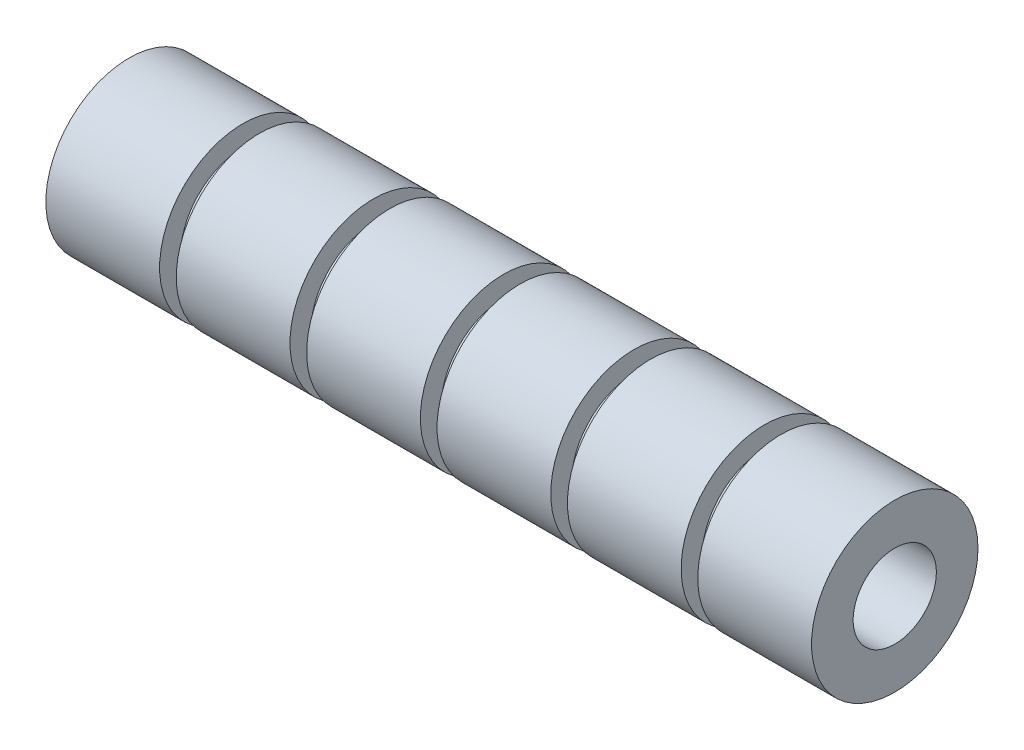
ISO-10303-21;
HEADER;
FILE_DESCRIPTION(('STEP AP214'),'2;1');
FILE_NAME('part.step','',(''),(''),'','','');
FILE_SCHEMA(('AUTOMOTIVE_DESIGN { 1 0 10303 214 1 1 1 1 }'));
ENDSEC;
DATA;
#1=APPLICATION_CONTEXT('core data for automotive mechanical design processes');
#2=APPLICATION_PROTOCOL_DEFINITION('international standard','automotive_design',2000,#1);
#3=PRODUCT_CONTEXT('',#1,'mechanical');
#4=PRODUCT('Part','Part','',(#3));
#5=PRODUCT_RELATED_PRODUCT_CATEGORY('part','',(#4));
#6=PRODUCT_DEFINITION_FORMATION('','',#4);
#7=PRODUCT_DEFINITION_CONTEXT('part definition',#1,'design');
#8=PRODUCT_DEFINITION('design','',#6,#7);
#9=PRODUCT_DEFINITION_SHAPE('','',#8);
#10=(LENGTH_UNIT() NAMED_UNIT(*) SI_UNIT(.MILLI.,.METRE.));
#11=(NAMED_UNIT(*) PLANE_ANGLE_UNIT() SI_UNIT($,.RADIAN.));
#12=(NAMED_UNIT(*) SI_UNIT($,.STERADIAN.) SOLID_ANGLE_UNIT());
#13=UNCERTAINTY_MEASURE_WITH_UNIT(LENGTH_MEASURE(1.E-05),#10,'distance_accuracy_value','');
#14=(GEOMETRIC_REPRESENTATION_CONTEXT(3) GLOBAL_UNCERTAINTY_ASSIGNED_CONTEXT((#13)) GLOBAL_UNIT_ASSIGNED_CONTEXT((#10,
#11,#12)) REPRESENTATION_CONTEXT('',''));
#15=CARTESIAN_POINT('',(0.,0.,0.));
#16=DIRECTION('',(0.,0.,1.));
#17=DIRECTION('',(1.,0.,0.));
#18=AXIS2_PLACEMENT_3D('',#15,#16,#17);
#19=CARTESIAN_POINT('',(46.,0.,0.));
#20=DIRECTION('',(1.,0.,0.));
#21=DIRECTION('',(0.,0.,-1.));
#22=AXIS2_PLACEMENT_3D('',#19,#20,#21);
#23=PLANE('',#22);
#24=CARTESIAN_POINT('',(46.,0.,0.));
#25=DIRECTION('',(1.,0.,0.));
#26=DIRECTION('',(0.,0.,-1.));
#27=AXIS2_PLACEMENT_3D('',#24,#25,#26);
#28=CIRCLE('',#27,5.);
#29=CARTESIAN_POINT('',(46.,0.,-5.));
#30=VERTEX_POINT('',#29);
#31=EDGE_CURVE('E10',#30,#30,#28,.T.);
#32=ORIENTED_EDGE('',*,*,#31,.F.);
#33=EDGE_LOOP('',(#32));
#34=FACE_BOUND('',#33,.T.);
#35=CARTESIAN_POINT('',(46.,0.,0.));
#36=DIRECTION('',(1.,0.,0.));
#37=DIRECTION('',(0.,0.,-1.));
#38=AXIS2_PLACEMENT_3D('',#35,#36,#37);
#39=CIRCLE('',#38,9.99999999999999);
#40=CARTESIAN_POINT('',(46.,0.,-9.99999999999999));
#41=VERTEX_POINT('',#40);
#42=EDGE_CURVE('E105',#41,#41,#39,.T.);
#43=ORIENTED_EDGE('',*,*,#42,.T.);
#44=EDGE_LOOP('',(#43));
#45=FACE_BOUND('',#44,.T.);
#46=ADVANCED_FACE('F33',(#34,#45),#23,.T.);
#47=CARTESIAN_POINT('',(-46.,0.,0.));
#48=DIRECTION('',(1.,0.,0.));
#49=DIRECTION('',(0.,0.,-1.));
#50=AXIS2_PLACEMENT_3D('',#47,#48,#49);
#51=PLANE('',#50);
#52=CARTESIAN_POINT('',(-46.,0.,0.));
#53=DIRECTION('',(1.,0.,0.));
#54=DIRECTION('',(0.,0.,-1.));
#55=AXIS2_PLACEMENT_3D('',#52,#53,#54);
#56=CIRCLE('',#55,5.);
#57=CARTESIAN_POINT('',(-46.,0.,-5.));
#58=VERTEX_POINT('',#57);
#59=EDGE_CURVE('E37',#58,#58,#56,.T.);
#60=ORIENTED_EDGE('',*,*,#59,.T.);
#61=EDGE_LOOP('',(#60));
#62=FACE_BOUND('',#61,.T.);
#63=CARTESIAN_POINT('',(-46.,0.,0.));
#64=DIRECTION('',(1.,0.,0.));
#65=DIRECTION('',(0.,0.,-1.));
#66=AXIS2_PLACEMENT_3D('',#63,#64,#65);
#67=CIRCLE('',#66,9.99999999999999);
#68=CARTESIAN_POINT('',(-46.,0.,-9.99999999999999));
#69=VERTEX_POINT('',#68);
#70=EDGE_CURVE('E78',#69,#69,#67,.T.);
#71=ORIENTED_EDGE('',*,*,#70,.F.);
#72=EDGE_LOOP('',(#71));
#73=FACE_BOUND('',#72,.T.);
#74=ADVANCED_FACE('F35',(#62,#73),#51,.F.);
#75=CARTESIAN_POINT('',(46.,0.,0.));
#76=DIRECTION('',(-1.,0.,0.));
#77=DIRECTION('',(0.,0.,1.));
#78=AXIS2_PLACEMENT_3D('',#75,#76,#77);
#79=CYLINDRICAL_SURFACE('',#78,5.);
#80=ORIENTED_EDGE('',*,*,#31,.T.);
#81=EDGE_LOOP('',(#80));
#82=FACE_BOUND('',#81,.T.);
#83=ORIENTED_EDGE('',*,*,#59,.F.);
#84=EDGE_LOOP('',(#83));
#85=FACE_BOUND('',#84,.T.);
#86=ADVANCED_FACE('F137',(#82,#85),#79,.F.);
#87=CARTESIAN_POINT('',(30.3333333333333,8.49999999999999,0.));
#88=DIRECTION('',(1.,0.,0.));
#89=DIRECTION('',(0.,0.,-1.));
#90=AXIS2_PLACEMENT_3D('',#87,#88,#89);
#91=PLANE('',#90);
#92=CARTESIAN_POINT('',(30.3333333333333,0.,0.));
#93=DIRECTION('',(-1.,0.,0.));
#94=DIRECTION('',(0.,0.,1.));
#95=AXIS2_PLACEMENT_3D('',#92,#93,#94);
#96=CIRCLE('',#95,7.49999999999937);
#97=CARTESIAN_POINT('',(30.3333333333333,0.,7.49999999999937));
#98=VERTEX_POINT('',#97);
#99=EDGE_CURVE('E44',#98,#98,#96,.T.);
#100=ORIENTED_EDGE('',*,*,#99,.T.);
#101=EDGE_LOOP('',(#100));
#102=FACE_BOUND('',#101,.T.);
#103=CARTESIAN_POINT('',(30.3333333333333,0.,0.));
#104=DIRECTION('',(1.,0.,0.));
#105=DIRECTION('',(0.,0.,-1.));
#106=AXIS2_PLACEMENT_3D('',#103,#104,#105);
#107=CIRCLE('',#106,9.99999999999999);
#108=CARTESIAN_POINT('',(30.3333333333333,0.,-9.99999999999999));
#109=VERTEX_POINT('',#108);
#110=EDGE_CURVE('E99',#109,#109,#107,.T.);
#111=ORIENTED_EDGE('',*,*,#110,.T.);
#112=EDGE_LOOP('',(#111));
#113=FACE_BOUND('',#112,.T.);
#114=ADVANCED_FACE('F128',(#102,#113),#91,.T.);
#115=CARTESIAN_POINT('',(-98.8215633503103,0.,0.));
#116=DIRECTION('',(-1.,0.,0.));
#117=DIRECTION('',(0.,0.,1.));
#118=AXIS2_PLACEMENT_3D('',#115,#116,#117);
#119=CYLINDRICAL_SURFACE('',#118,7.49999999999968);
#120=CARTESIAN_POINT('',(32.3333333333333,0.,0.));
#121=DIRECTION('',(-1.,0.,0.));
#122=DIRECTION('',(0.,0.,1.));
#123=AXIS2_PLACEMENT_3D('',#120,#121,#122);
#124=CIRCLE('',#123,7.5);
#125=CARTESIAN_POINT('',(32.3333333333333,0.,7.5));
#126=VERTEX_POINT('',#125);
#127=EDGE_CURVE('E48',#126,#126,#124,.T.);
#128=ORIENTED_EDGE('',*,*,#127,.T.);
#129=EDGE_LOOP('',(#128));
#130=FACE_BOUND('',#129,.T.);
#131=ORIENTED_EDGE('',*,*,#99,.F.);
#132=EDGE_LOOP('',(#131));
#133=FACE_BOUND('',#132,.T.);
#134=ADVANCED_FACE('F118',(#130,#133),#119,.T.);
#135=CARTESIAN_POINT('',(32.3333333333333,8.5,0.));
#136=DIRECTION('',(-1.,0.,0.));
#137=DIRECTION('',(0.,0.,1.));
#138=AXIS2_PLACEMENT_3D('',#135,#136,#137);
#139=PLANE('',#138);
#140=ORIENTED_EDGE('',*,*,#127,.F.);
#141=EDGE_LOOP('',(#140));
#142=FACE_BOUND('',#141,.T.);
#143=CARTESIAN_POINT('',(32.3333333333333,0.,0.));
#144=DIRECTION('',(1.,0.,0.));
#145=DIRECTION('',(0.,0.,-1.));
#146=AXIS2_PLACEMENT_3D('',#143,#144,#145);
#147=CIRCLE('',#146,9.99999999999999);
#148=CARTESIAN_POINT('',(32.3333333333333,0.,-9.99999999999999));
#149=VERTEX_POINT('',#148);
#150=EDGE_CURVE('E108',#149,#149,#147,.T.);
#151=ORIENTED_EDGE('',*,*,#150,.F.);
#152=EDGE_LOOP('',(#151));
#153=FACE_BOUND('',#152,.T.);
#154=ADVANCED_FACE('F115',(#142,#153),#139,.T.);
#155=CARTESIAN_POINT('',(-32.3333333333333,8.49999999999999,0.));
#156=DIRECTION('',(1.,0.,0.));
#157=DIRECTION('',(0.,0.,-1.));
#158=AXIS2_PLACEMENT_3D('',#155,#156,#157);
#159=PLANE('',#158);
#160=CARTESIAN_POINT('',(-32.3333333333333,0.,0.));
#161=DIRECTION('',(-1.,0.,0.));
#162=DIRECTION('',(0.,0.,1.));
#163=AXIS2_PLACEMENT_3D('',#160,#161,#162);
#164=CIRCLE('',#163,7.49999999999937);
#165=CARTESIAN_POINT('',(-32.3333333333333,0.,7.49999999999937));
#166=VERTEX_POINT('',#165);
#167=EDGE_CURVE('E52',#166,#166,#164,.T.);
#168=ORIENTED_EDGE('',*,*,#167,.T.);
#169=EDGE_LOOP('',(#168));
#170=FACE_BOUND('',#169,.T.);
#171=CARTESIAN_POINT('',(-32.3333333333333,0.,0.));
#172=DIRECTION('',(1.,0.,0.));
#173=DIRECTION('',(0.,0.,-1.));
#174=AXIS2_PLACEMENT_3D('',#171,#172,#173);
#175=CIRCLE('',#174,9.99999999999999);
#176=CARTESIAN_POINT('',(-32.3333333333333,0.,-9.99999999999999));
#177=VERTEX_POINT('',#176);
#178=EDGE_CURVE('E59',#177,#177,#175,.T.);
#179=ORIENTED_EDGE('',*,*,#178,.T.);
#180=EDGE_LOOP('',(#179));
#181=FACE_BOUND('',#180,.T.);
#182=ADVANCED_FACE('F117',(#170,#181),#159,.T.);
#183=CARTESIAN_POINT('',(-98.8215633503103,0.,0.));
#184=DIRECTION('',(-1.,0.,0.));
#185=DIRECTION('',(0.,0.,1.));
#186=AXIS2_PLACEMENT_3D('',#183,#184,#185);
#187=CYLINDRICAL_SURFACE('',#186,7.49999999999968);
#188=CARTESIAN_POINT('',(-30.3333333333333,0.,0.));
#189=DIRECTION('',(-1.,0.,0.));
#190=DIRECTION('',(0.,0.,1.));
#191=AXIS2_PLACEMENT_3D('',#188,#189,#190);
#192=CIRCLE('',#191,7.5);
#193=CARTESIAN_POINT('',(-30.3333333333333,0.,7.5));
#194=VERTEX_POINT('',#193);
#195=EDGE_CURVE('E56',#194,#194,#192,.T.);
#196=ORIENTED_EDGE('',*,*,#195,.T.);
#197=EDGE_LOOP('',(#196));
#198=FACE_BOUND('',#197,.T.);
#199=ORIENTED_EDGE('',*,*,#167,.F.);
#200=EDGE_LOOP('',(#199));
#201=FACE_BOUND('',#200,.T.);
#202=ADVANCED_FACE('F125',(#198,#201),#187,.T.);
#203=CARTESIAN_POINT('',(-30.3333333333333,8.49999999999999,0.));
#204=DIRECTION('',(-1.,0.,0.));
#205=DIRECTION('',(0.,0.,1.));
#206=AXIS2_PLACEMENT_3D('',#203,#204,#205);
#207=PLANE('',#206);
#208=ORIENTED_EDGE('',*,*,#195,.F.);
#209=EDGE_LOOP('',(#208));
#210=FACE_BOUND('',#209,.T.);
#211=CARTESIAN_POINT('',(-30.3333333333333,0.,0.));
#212=DIRECTION('',(1.,0.,0.));
#213=DIRECTION('',(0.,0.,-1.));
#214=AXIS2_PLACEMENT_3D('',#211,#212,#213);
#215=CIRCLE('',#214,9.99999999999999);
#216=CARTESIAN_POINT('',(-30.3333333333333,0.,-9.99999999999999));
#217=VERTEX_POINT('',#216);
#218=EDGE_CURVE('E84',#217,#217,#215,.T.);
#219=ORIENTED_EDGE('',*,*,#218,.F.);
#220=EDGE_LOOP('',(#219));
#221=FACE_BOUND('',#220,.T.);
#222=ADVANCED_FACE('F189',(#210,#221),#207,.T.);
#223=CARTESIAN_POINT('',(14.6666666666667,8.49999999999999,0.));
#224=DIRECTION('',(1.,0.,0.));
#225=DIRECTION('',(0.,0.,-1.));
#226=AXIS2_PLACEMENT_3D('',#223,#224,#225);
#227=PLANE('',#226);
#228=CARTESIAN_POINT('',(14.6666666666667,0.,0.));
#229=DIRECTION('',(-1.,0.,0.));
#230=DIRECTION('',(0.,0.,1.));
#231=AXIS2_PLACEMENT_3D('',#228,#229,#230);
#232=CIRCLE('',#231,7.49999999999937);
#233=CARTESIAN_POINT('',(14.6666666666667,0.,7.49999999999937));
#234=VERTEX_POINT('',#233);
#235=EDGE_CURVE('E51',#234,#234,#232,.T.);
#236=ORIENTED_EDGE('',*,*,#235,.T.);
#237=EDGE_LOOP('',(#236));
#238=FACE_BOUND('',#237,.T.);
#239=CARTESIAN_POINT('',(14.6666666666667,0.,0.));
#240=DIRECTION('',(1.,0.,0.));
#241=DIRECTION('',(0.,0.,-1.));
#242=AXIS2_PLACEMENT_3D('',#239,#240,#241);
#243=CIRCLE('',#242,9.99999999999999);
#244=CARTESIAN_POINT('',(14.6666666666667,0.,-9.99999999999999));
#245=VERTEX_POINT('',#244);
#246=EDGE_CURVE('E93',#245,#245,#243,.T.);
#247=ORIENTED_EDGE('',*,*,#246,.T.);
#248=EDGE_LOOP('',(#247));
#249=FACE_BOUND('',#248,.T.);
#250=ADVANCED_FACE('F185',(#238,#249),#227,.T.);
#251=CARTESIAN_POINT('',(-98.8215633503103,0.,0.));
#252=DIRECTION('',(-1.,0.,0.));
#253=DIRECTION('',(0.,0.,1.));
#254=AXIS2_PLACEMENT_3D('',#251,#252,#253);
#255=CYLINDRICAL_SURFACE('',#254,7.49999999999968);
#256=CARTESIAN_POINT('',(16.6666666666667,0.,0.));
#257=DIRECTION('',(-1.,0.,0.));
#258=DIRECTION('',(0.,0.,1.));
#259=AXIS2_PLACEMENT_3D('',#256,#257,#258);
#260=CIRCLE('',#259,7.5);
#261=CARTESIAN_POINT('',(16.6666666666667,0.,7.5));
#262=VERTEX_POINT('',#261);
#263=EDGE_CURVE('E69',#262,#262,#260,.T.);
#264=ORIENTED_EDGE('',*,*,#263,.T.);
#265=EDGE_LOOP('',(#264));
#266=FACE_BOUND('',#265,.T.);
#267=ORIENTED_EDGE('',*,*,#235,.F.);
#268=EDGE_LOOP('',(#267));
#269=FACE_BOUND('',#268,.T.);
#270=ADVANCED_FACE('F181',(#266,#269),#255,.T.);
#271=CARTESIAN_POINT('',(16.6666666666667,8.5,0.));
#272=DIRECTION('',(-1.,0.,0.));
#273=DIRECTION('',(0.,0.,1.));
#274=AXIS2_PLACEMENT_3D('',#271,#272,#273);
#275=PLANE('',#274);
#276=ORIENTED_EDGE('',*,*,#263,.F.);
#277=EDGE_LOOP('',(#276));
#278=FACE_BOUND('',#277,.T.);
#279=CARTESIAN_POINT('',(16.6666666666667,0.,0.));
#280=DIRECTION('',(1.,0.,0.));
#281=DIRECTION('',(0.,0.,-1.));
#282=AXIS2_PLACEMENT_3D('',#279,#280,#281);
#283=CIRCLE('',#282,9.99999999999999);
#284=CARTESIAN_POINT('',(16.6666666666667,0.,-9.99999999999999));
#285=VERTEX_POINT('',#284);
#286=EDGE_CURVE('E102',#285,#285,#283,.T.);
#287=ORIENTED_EDGE('',*,*,#286,.F.);
#288=EDGE_LOOP('',(#287));
#289=FACE_BOUND('',#288,.T.);
#290=ADVANCED_FACE('F177',(#278,#289),#275,.T.);
#291=CARTESIAN_POINT('',(-16.6666666666667,8.49999999999999,0.));
#292=DIRECTION('',(1.,0.,0.));
#293=DIRECTION('',(0.,0.,-1.));
#294=AXIS2_PLACEMENT_3D('',#291,#292,#293);
#295=PLANE('',#294);
#296=CARTESIAN_POINT('',(-16.6666666666667,0.,0.));
#297=DIRECTION('',(-1.,0.,0.));
#298=DIRECTION('',(0.,0.,1.));
#299=AXIS2_PLACEMENT_3D('',#296,#297,#298);
#300=CIRCLE('',#299,7.49999999999937);
#301=CARTESIAN_POINT('',(-16.6666666666667,0.,7.49999999999937));
#302=VERTEX_POINT('',#301);
#303=EDGE_CURVE('E60',#302,#302,#300,.T.);
#304=ORIENTED_EDGE('',*,*,#303,.T.);
#305=EDGE_LOOP('',(#304));
#306=FACE_BOUND('',#305,.T.);
#307=CARTESIAN_POINT('',(-16.6666666666667,0.,0.));
#308=DIRECTION('',(1.,0.,0.));
#309=DIRECTION('',(0.,0.,-1.));
#310=AXIS2_PLACEMENT_3D('',#307,#308,#309);
#311=CIRCLE('',#310,9.99999999999999);
#312=CARTESIAN_POINT('',(-16.6666666666667,0.,-9.99999999999999));
#313=VERTEX_POINT('',#312);
#314=EDGE_CURVE('E81',#313,#313,#311,.T.);
#315=ORIENTED_EDGE('',*,*,#314,.T.);
#316=EDGE_LOOP('',(#315));
#317=FACE_BOUND('',#316,.T.);
#318=ADVANCED_FACE('F180',(#306,#317),#295,.T.);
#319=CARTESIAN_POINT('',(-98.8215633503103,0.,0.));
#320=DIRECTION('',(-1.,0.,0.));
#321=DIRECTION('',(0.,0.,1.));
#322=AXIS2_PLACEMENT_3D('',#319,#320,#321);
#323=CYLINDRICAL_SURFACE('',#322,7.49999999999968);
#324=CARTESIAN_POINT('',(-14.6666666666667,0.,0.));
#325=DIRECTION('',(-1.,0.,0.));
#326=DIRECTION('',(0.,0.,1.));
#327=AXIS2_PLACEMENT_3D('',#324,#325,#326);
#328=CIRCLE('',#327,7.5);
#329=CARTESIAN_POINT('',(-14.6666666666667,0.,7.5));
#330=VERTEX_POINT('',#329);
#331=EDGE_CURVE('E55',#330,#330,#328,.T.);
#332=ORIENTED_EDGE('',*,*,#331,.T.);
#333=EDGE_LOOP('',(#332));
#334=FACE_BOUND('',#333,.T.);
#335=ORIENTED_EDGE('',*,*,#303,.F.);
#336=EDGE_LOOP('',(#335));
#337=FACE_BOUND('',#336,.T.);
#338=ADVANCED_FACE('F205',(#334,#337),#323,.T.);
#339=CARTESIAN_POINT('',(-14.6666666666667,8.5,0.));
#340=DIRECTION('',(-1.,0.,0.));
#341=DIRECTION('',(0.,0.,1.));
#342=AXIS2_PLACEMENT_3D('',#339,#340,#341);
#343=PLANE('',#342);
#344=ORIENTED_EDGE('',*,*,#331,.F.);
#345=EDGE_LOOP('',(#344));
#346=FACE_BOUND('',#345,.T.);
#347=CARTESIAN_POINT('',(-14.6666666666667,0.,0.));
#348=DIRECTION('',(1.,0.,0.));
#349=DIRECTION('',(0.,0.,-1.));
#350=AXIS2_PLACEMENT_3D('',#347,#348,#349);
#351=CIRCLE('',#350,9.99999999999999);
#352=CARTESIAN_POINT('',(-14.6666666666667,0.,-9.99999999999999));
#353=VERTEX_POINT('',#352);
#354=EDGE_CURVE('E90',#353,#353,#351,.T.);
#355=ORIENTED_EDGE('',*,*,#354,.F.);
#356=EDGE_LOOP('',(#355));
#357=FACE_BOUND('',#356,.T.);
#358=ADVANCED_FACE('F201',(#346,#357),#343,.T.);
#359=CARTESIAN_POINT('',(-1.,8.49999999999999,0.));
#360=DIRECTION('',(1.,0.,0.));
#361=DIRECTION('',(0.,0.,-1.));
#362=AXIS2_PLACEMENT_3D('',#359,#360,#361);
#363=PLANE('',#362);
#364=CARTESIAN_POINT('',(-1.,0.,0.));
#365=DIRECTION('',(-1.,0.,0.));
#366=DIRECTION('',(0.,0.,1.));
#367=AXIS2_PLACEMENT_3D('',#364,#365,#366);
#368=CIRCLE('',#367,7.49999999999937);
#369=CARTESIAN_POINT('',(-1.,0.,7.49999999999937));
#370=VERTEX_POINT('',#369);
#371=EDGE_CURVE('E66',#370,#370,#368,.T.);
#372=ORIENTED_EDGE('',*,*,#371,.T.);
#373=EDGE_LOOP('',(#372));
#374=FACE_BOUND('',#373,.T.);
#375=CARTESIAN_POINT('',(-0.999999999999994,0.,0.));
#376=DIRECTION('',(1.,0.,0.));
#377=DIRECTION('',(0.,0.,-1.));
#378=AXIS2_PLACEMENT_3D('',#375,#376,#377);
#379=CIRCLE('',#378,9.99999999999999);
#380=CARTESIAN_POINT('',(-0.999999999999994,0.,-9.99999999999999));
#381=VERTEX_POINT('',#380);
#382=EDGE_CURVE('E87',#381,#381,#379,.T.);
#383=ORIENTED_EDGE('',*,*,#382,.T.);
#384=EDGE_LOOP('',(#383));
#385=FACE_BOUND('',#384,.T.);
#386=ADVANCED_FACE('F197',(#374,#385),#363,.T.);
#387=CARTESIAN_POINT('',(-98.8215633503103,0.,0.));
#388=DIRECTION('',(-1.,0.,0.));
#389=DIRECTION('',(0.,0.,1.));
#390=AXIS2_PLACEMENT_3D('',#387,#388,#389);
#391=CYLINDRICAL_SURFACE('',#390,7.49999999999968);
#392=CARTESIAN_POINT('',(1.,0.,0.));
#393=DIRECTION('',(-1.,0.,0.));
#394=DIRECTION('',(0.,0.,1.));
#395=AXIS2_PLACEMENT_3D('',#392,#393,#394);
#396=CIRCLE('',#395,7.5);
#397=CARTESIAN_POINT('',(1.,0.,7.5));
#398=VERTEX_POINT('',#397);
#399=EDGE_CURVE('E63',#398,#398,#396,.T.);
#400=ORIENTED_EDGE('',*,*,#399,.T.);
#401=EDGE_LOOP('',(#400));
#402=FACE_BOUND('',#401,.T.);
#403=ORIENTED_EDGE('',*,*,#371,.F.);
#404=EDGE_LOOP('',(#403));
#405=FACE_BOUND('',#404,.T.);
#406=ADVANCED_FACE('F193',(#402,#405),#391,.T.);
#407=CARTESIAN_POINT('',(1.,8.49999999999999,0.));
#408=DIRECTION('',(-1.,0.,0.));
#409=DIRECTION('',(0.,0.,1.));
#410=AXIS2_PLACEMENT_3D('',#407,#408,#409);
#411=PLANE('',#410);
#412=ORIENTED_EDGE('',*,*,#399,.F.);
#413=EDGE_LOOP('',(#412));
#414=FACE_BOUND('',#413,.T.);
#415=CARTESIAN_POINT('',(0.999999999999994,0.,0.));
#416=DIRECTION('',(1.,0.,0.));
#417=DIRECTION('',(0.,0.,-1.));
#418=AXIS2_PLACEMENT_3D('',#415,#416,#417);
#419=CIRCLE('',#418,9.99999999999999);
#420=CARTESIAN_POINT('',(0.999999999999994,0.,-9.99999999999999));
#421=VERTEX_POINT('',#420);
#422=EDGE_CURVE('E96',#421,#421,#419,.T.);
#423=ORIENTED_EDGE('',*,*,#422,.F.);
#424=EDGE_LOOP('',(#423));
#425=FACE_BOUND('',#424,.T.);
#426=ADVANCED_FACE('F175',(#414,#425),#411,.T.);
#427=CARTESIAN_POINT('',(58.0898267659472,0.,0.));
#428=DIRECTION('',(1.,0.,0.));
#429=DIRECTION('',(0.,0.,-1.));
#430=AXIS2_PLACEMENT_3D('',#427,#428,#429);
#431=CYLINDRICAL_SURFACE('',#430,9.99999999999999);
#432=ORIENTED_EDGE('',*,*,#70,.T.);
#433=EDGE_LOOP('',(#432));
#434=FACE_BOUND('',#433,.T.);
#435=ORIENTED_EDGE('',*,*,#178,.F.);
#436=EDGE_LOOP('',(#435));
#437=FACE_BOUND('',#436,.T.);
#438=ADVANCED_FACE('F171',(#434,#437),#431,.T.);
#439=CARTESIAN_POINT('',(58.0898267659472,0.,0.));
#440=DIRECTION('',(1.,0.,0.));
#441=DIRECTION('',(0.,0.,-1.));
#442=AXIS2_PLACEMENT_3D('',#439,#440,#441);
#443=CYLINDRICAL_SURFACE('',#442,9.99999999999999);
#444=ORIENTED_EDGE('',*,*,#218,.T.);
#445=EDGE_LOOP('',(#444));
#446=FACE_BOUND('',#445,.T.);
#447=ORIENTED_EDGE('',*,*,#314,.F.);
#448=EDGE_LOOP('',(#447));
#449=FACE_BOUND('',#448,.T.);
#450=ADVANCED_FACE('F167',(#446,#449),#443,.T.);
#451=CARTESIAN_POINT('',(58.0898267659472,0.,0.));
#452=DIRECTION('',(1.,0.,0.));
#453=DIRECTION('',(0.,0.,-1.));
#454=AXIS2_PLACEMENT_3D('',#451,#452,#453);
#455=CYLINDRICAL_SURFACE('',#454,9.99999999999999);
#456=ORIENTED_EDGE('',*,*,#354,.T.);
#457=EDGE_LOOP('',(#456));
#458=FACE_BOUND('',#457,.T.);
#459=ORIENTED_EDGE('',*,*,#382,.F.);
#460=EDGE_LOOP('',(#459));
#461=FACE_BOUND('',#460,.T.);
#462=ADVANCED_FACE('F161',(#458,#461),#455,.T.);
#463=CARTESIAN_POINT('',(58.0898267659472,0.,0.));
#464=DIRECTION('',(1.,0.,0.));
#465=DIRECTION('',(0.,0.,-1.));
#466=AXIS2_PLACEMENT_3D('',#463,#464,#465);
#467=CYLINDRICAL_SURFACE('',#466,9.99999999999999);
#468=ORIENTED_EDGE('',*,*,#422,.T.);
#469=EDGE_LOOP('',(#468));
#470=FACE_BOUND('',#469,.T.);
#471=ORIENTED_EDGE('',*,*,#246,.F.);
#472=EDGE_LOOP('',(#471));
#473=FACE_BOUND('',#472,.T.);
#474=ADVANCED_FACE('F153',(#470,#473),#467,.T.);
#475=CARTESIAN_POINT('',(58.0898267659472,0.,0.));
#476=DIRECTION('',(1.,0.,0.));
#477=DIRECTION('',(0.,0.,-1.));
#478=AXIS2_PLACEMENT_3D('',#475,#476,#477);
#479=CYLINDRICAL_SURFACE('',#478,9.99999999999999);
#480=ORIENTED_EDGE('',*,*,#286,.T.);
#481=EDGE_LOOP('',(#480));
#482=FACE_BOUND('',#481,.T.);
#483=ORIENTED_EDGE('',*,*,#110,.F.);
#484=EDGE_LOOP('',(#483));
#485=FACE_BOUND('',#484,.T.);
#486=ADVANCED_FACE('F151',(#482,#485),#479,.T.);
#487=CARTESIAN_POINT('',(58.0898267659472,0.,0.));
#488=DIRECTION('',(1.,0.,0.));
#489=DIRECTION('',(0.,0.,-1.));
#490=AXIS2_PLACEMENT_3D('',#487,#488,#489);
#491=CYLINDRICAL_SURFACE('',#490,9.99999999999999);
#492=ORIENTED_EDGE('',*,*,#150,.T.);
#493=EDGE_LOOP('',(#492));
#494=FACE_BOUND('',#493,.T.);
#495=ORIENTED_EDGE('',*,*,#42,.F.);
#496=EDGE_LOOP('',(#495));
#497=FACE_BOUND('',#496,.T.);
#498=ADVANCED_FACE('F112',(#494,#497),#491,.T.);
#499=CLOSED_SHELL('',(#46,#74,#86,#114,#134,#154,#182,#202,#222,#250,#270,#290,#318,#338,#358,
#386,#406,#426,#438,#450,#462,#474,#486,#498));
#500=MANIFOLD_SOLID_BREP('B2',#499);
#501=ADVANCED_BREP_SHAPE_REPRESENTATION('',(#18,#500),#14);
#502=SHAPE_DEFINITION_REPRESENTATION(#9,#501);
ENDSEC;
END-ISO-10303-21;
